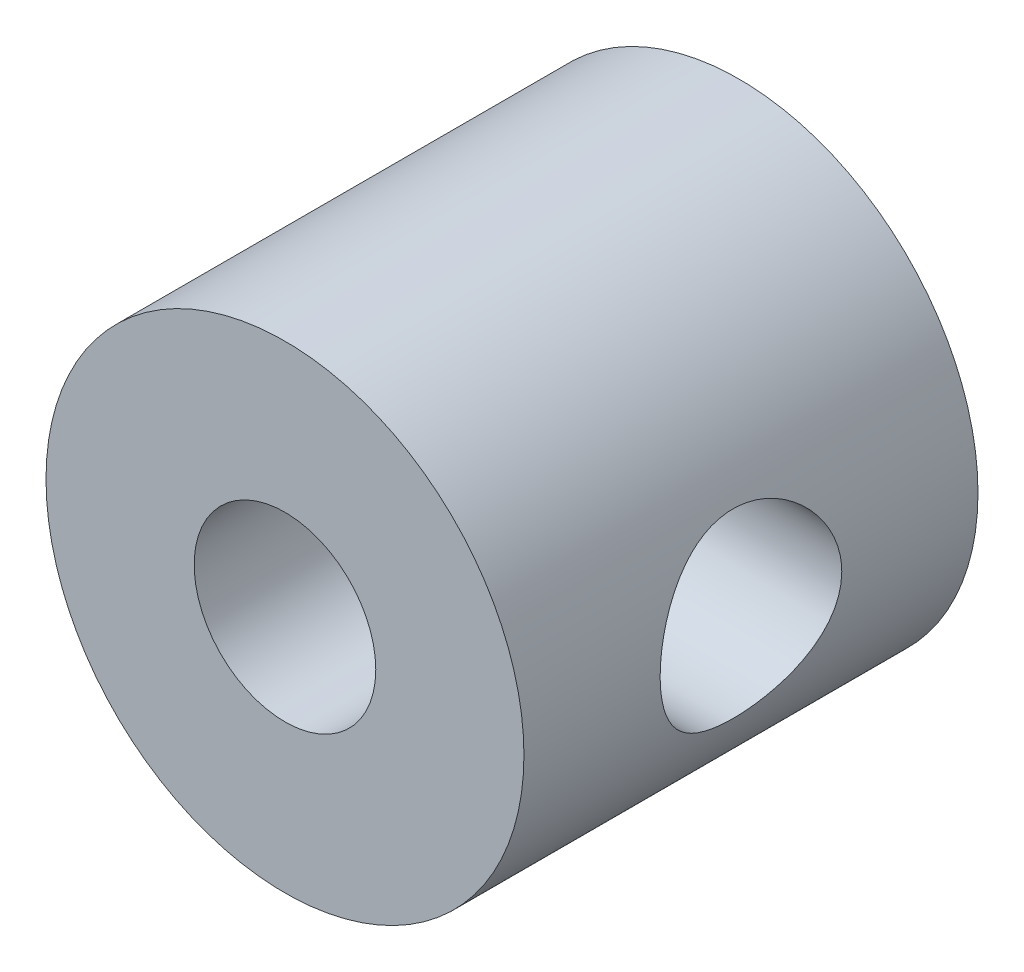
ISO-10303-21;
HEADER;
FILE_DESCRIPTION(('STEP AP214'),'2;1');
FILE_NAME('part.step','',(''),(''),'','','');
FILE_SCHEMA(('AUTOMOTIVE_DESIGN { 1 0 10303 214 1 1 1 1 }'));
ENDSEC;
DATA;
#1=APPLICATION_CONTEXT('core data for automotive mechanical design processes');
#2=APPLICATION_PROTOCOL_DEFINITION('international standard','automotive_design',2000,#1);
#3=PRODUCT_CONTEXT('',#1,'mechanical');
#4=PRODUCT('Part','Part','',(#3));
#5=PRODUCT_RELATED_PRODUCT_CATEGORY('part','',(#4));
#6=PRODUCT_DEFINITION_FORMATION('','',#4);
#7=PRODUCT_DEFINITION_CONTEXT('part definition',#1,'design');
#8=PRODUCT_DEFINITION('design','',#6,#7);
#9=PRODUCT_DEFINITION_SHAPE('','',#8);
#10=(LENGTH_UNIT() NAMED_UNIT(*) SI_UNIT(.MILLI.,.METRE.));
#11=(NAMED_UNIT(*) PLANE_ANGLE_UNIT() SI_UNIT($,.RADIAN.));
#12=(NAMED_UNIT(*) SI_UNIT($,.STERADIAN.) SOLID_ANGLE_UNIT());
#13=UNCERTAINTY_MEASURE_WITH_UNIT(LENGTH_MEASURE(1.E-05),#10,'distance_accuracy_value','');
#14=(GEOMETRIC_REPRESENTATION_CONTEXT(3) GLOBAL_UNCERTAINTY_ASSIGNED_CONTEXT((#13)) GLOBAL_UNIT_ASSIGNED_CONTEXT((#10,
#11,#12)) REPRESENTATION_CONTEXT('',''));
#15=CARTESIAN_POINT('',(0.,0.,0.));
#16=DIRECTION('',(0.,0.,1.));
#17=DIRECTION('',(1.,0.,0.));
#18=AXIS2_PLACEMENT_3D('',#15,#16,#17);
#19=CARTESIAN_POINT('',(0.,0.,0.));
#20=DIRECTION('',(0.,0.,1.));
#21=DIRECTION('',(1.,0.,0.));
#22=AXIS2_PLACEMENT_3D('',#19,#20,#21);
#23=CYLINDRICAL_SURFACE('',#22,1.9);
#24=CARTESIAN_POINT('',(0.,0.,9.5));
#25=DIRECTION('',(0.,0.,1.));
#26=DIRECTION('',(1.,0.,0.));
#27=AXIS2_PLACEMENT_3D('',#24,#25,#26);
#28=CIRCLE('',#27,1.9);
#29=CARTESIAN_POINT('',(1.9,0.,9.5));
#30=VERTEX_POINT('',#29);
#31=EDGE_CURVE('E85',#30,#30,#28,.T.);
#32=ORIENTED_EDGE('',*,*,#31,.T.);
#33=EDGE_LOOP('',(#32));
#34=FACE_BOUND('',#33,.T.);
#35=CARTESIAN_POINT('',(0.,0.,4.75));
#36=DIRECTION('',(-0.707106781186547,0.,0.707106781186547));
#37=DIRECTION('',(0.707106781186547,0.,0.707106781186547));
#38=AXIS2_PLACEMENT_3D('',#35,#36,#37);
#39=ELLIPSE('',#38,2.68700576850888,1.9);
#40=CARTESIAN_POINT('',(0.,1.9,4.75));
#41=VERTEX_POINT('',#40);
#42=CARTESIAN_POINT('',(0.,-1.9,4.75));
#43=VERTEX_POINT('',#42);
#44=EDGE_CURVE('E58',#41,#43,#39,.F.);
#45=ORIENTED_EDGE('',*,*,#44,.T.);
#46=CARTESIAN_POINT('',(0.,0.,4.75));
#47=DIRECTION('',(0.707106781186547,0.,0.707106781186547));
#48=DIRECTION('',(-0.707106781186547,0.,0.707106781186547));
#49=AXIS2_PLACEMENT_3D('',#46,#47,#48);
#50=ELLIPSE('',#49,2.68700576850888,1.9);
#51=EDGE_CURVE('E11',#43,#41,#50,.F.);
#52=ORIENTED_EDGE('',*,*,#51,.T.);
#53=EDGE_LOOP('',(#45,#52));
#54=FACE_BOUND('',#53,.T.);
#55=ADVANCED_FACE('F43',(#34,#54),#23,.F.);
#56=CARTESIAN_POINT('',(0.,0.,9.5));
#57=DIRECTION('',(0.,0.,-1.));
#58=DIRECTION('',(-1.,0.,0.));
#59=AXIS2_PLACEMENT_3D('',#56,#57,#58);
#60=CYLINDRICAL_SURFACE('',#59,5.);
#61=CARTESIAN_POINT('',(-5.,0.,2.85));
#62=CARTESIAN_POINT('',(-5.00000314148827,0.102799946037765,2.84999584618423));
#63=CARTESIAN_POINT('',(-4.99680228989486,0.205571843604519,2.85836893361314));
#64=CARTESIAN_POINT('',(-4.98435404669264,0.408038934279459,2.89150016002816));
#65=CARTESIAN_POINT('',(-4.97510770315697,0.507734657550122,2.91625545893088));
#66=CARTESIAN_POINT('',(-4.9515593739685,0.701099790647796,2.98114557793642));
#67=CARTESIAN_POINT('',(-4.93726730476453,0.79478059792097,3.02125024457916));
#68=CARTESIAN_POINT('',(-4.90504670913707,0.974076337852587,3.11554516092965));
#69=CARTESIAN_POINT('',(-4.88711718065938,1.05968903835505,3.16973929319079));
#70=CARTESIAN_POINT('',(-4.84859789590344,1.22413732997016,3.29313167643611));
#71=CARTESIAN_POINT('',(-4.82793146758365,1.30257632185067,3.36283431791343));
#72=CARTESIAN_POINT('',(-4.7866396882284,1.44697300442312,3.5141943697409));
#73=CARTESIAN_POINT('',(-4.76601435231863,1.51292672431606,3.59585556877857));
#74=CARTESIAN_POINT('',(-4.72624148165763,1.63303669782607,3.77272924039272));
#75=CARTESIAN_POINT('',(-4.70718397732858,1.68662691351059,3.86834837673399));
#76=CARTESIAN_POINT('',(-4.67390104311853,1.77678814062093,4.06808001540759));
#77=CARTESIAN_POINT('',(-4.65967362483106,1.81336615777595,4.17218900077102));
#78=CARTESIAN_POINT('',(-4.63848318884947,1.86688935206445,4.38137509299367));
#79=CARTESIAN_POINT('',(-4.63124079326371,1.88459286653868,4.48622889701143));
#80=CARTESIAN_POINT('',(-4.62402433436697,1.9022352797225,4.69764992417825));
#81=CARTESIAN_POINT('',(-4.62404716488918,1.90218177025023,4.80421639560884));
#82=CARTESIAN_POINT('',(-4.63111820371223,1.88489047329825,5.00903324960867));
#83=CARTESIAN_POINT('',(-4.63773273521278,1.86871346296971,5.10739096264822));
#84=CARTESIAN_POINT('',(-4.65651975451297,1.82139096396027,5.29987378345734));
#85=CARTESIAN_POINT('',(-4.66869310243304,1.79024315879619,5.39399823373378));
#86=CARTESIAN_POINT('',(-4.69748147158025,1.71329420545471,5.57747371282299));
#87=CARTESIAN_POINT('',(-4.71417741416087,1.66722275924216,5.66669812192209));
#88=CARTESIAN_POINT('',(-4.75010374416888,1.56192297174274,5.83645385764242));
#89=CARTESIAN_POINT('',(-4.76933502200296,1.50269000311216,5.91698211202574));
#90=CARTESIAN_POINT('',(-4.80978709665352,1.36792669110658,6.07291885227451));
#91=CARTESIAN_POINT('',(-4.83105350406012,1.29155254717806,6.14758809653555));
#92=CARTESIAN_POINT('',(-4.87203874292135,1.12712495183049,6.28328193745198));
#93=CARTESIAN_POINT('',(-4.89175732325386,1.03906961144242,6.34430432297494));
#94=CARTESIAN_POINT('',(-4.92783612775859,0.851852487995205,6.45181709832506));
#95=CARTESIAN_POINT('',(-4.94413653388479,0.752533399397338,6.49805507331473));
#96=CARTESIAN_POINT('',(-4.97109705743368,0.54675211735048,6.5729191856317));
#97=CARTESIAN_POINT('',(-4.98175974975373,0.440293209930096,6.60155336406637));
#98=CARTESIAN_POINT('',(-4.9957875569285,0.229470984419312,6.63896149494266));
#99=CARTESIAN_POINT('',(-4.99951788872478,0.125308381952605,6.6487305140866));
#100=CARTESIAN_POINT('',(-5.00039355163115,-0.0832228861010039,6.65103642794049));
#101=CARTESIAN_POINT('',(-4.99754038959186,-0.187591499072481,6.64357726588996));
#102=CARTESIAN_POINT('',(-4.98581030398745,-0.389231183311321,6.61239025498067));
#103=CARTESIAN_POINT('',(-4.97717686326153,-0.48661956252922,6.58931960487263));
#104=CARTESIAN_POINT('',(-4.95500073108836,-0.676070523965439,6.52843546753041));
#105=CARTESIAN_POINT('',(-4.9414574019024,-0.768132412531034,6.49062006507222));
#106=CARTESIAN_POINT('',(-4.91029493799233,-0.947380130569952,6.40010632845678));
#107=CARTESIAN_POINT('',(-4.89256680627251,-1.0343402755648,6.34699974496449));
#108=CARTESIAN_POINT('',(-4.85498822454556,-1.19840935888328,6.22787083372912));
#109=CARTESIAN_POINT('',(-4.83513697776912,-1.27551457482178,6.16184364933531));
#110=CARTESIAN_POINT('',(-4.79402533228151,-1.42249454419624,6.01412025587449));
#111=CARTESIAN_POINT('',(-4.77275146045522,-1.4916645142899,5.93172473214307));
#112=CARTESIAN_POINT('',(-4.73232674163432,-1.61534182230436,5.75608504575801));
#113=CARTESIAN_POINT('',(-4.71317611359821,-1.66984764881774,5.66283976625689));
#114=CARTESIAN_POINT('',(-4.67922676081744,-1.76275609269656,5.46726200672331));
#115=CARTESIAN_POINT('',(-4.66445090027486,-1.80107453812967,5.36488530080581));
#116=CARTESIAN_POINT('',(-4.64140564627876,-1.85966772399062,5.15441157034014));
#117=CARTESIAN_POINT('',(-4.63313207948134,-1.87995403901349,5.04631826249101));
#118=CARTESIAN_POINT('',(-4.62459224889872,-1.90085822079159,4.83513950016959));
#119=CARTESIAN_POINT('',(-4.62383507549612,-1.90268207203628,4.73219233513062));
#120=CARTESIAN_POINT('',(-4.62914978373433,-1.88971442556339,4.52753946976649));
#121=CARTESIAN_POINT('',(-4.63522098096587,-1.87492459303962,4.42583364605413));
#122=CARTESIAN_POINT('',(-4.65309482864238,-1.83009780463443,4.22988010563044));
#123=CARTESIAN_POINT('',(-4.66470670311429,-1.80056695115269,4.13549770118766));
#124=CARTESIAN_POINT('',(-4.69223770514172,-1.72754746605826,3.95297523134959));
#125=CARTESIAN_POINT('',(-4.70815793493193,-1.68405526209124,3.86483677067416));
#126=CARTESIAN_POINT('',(-4.74356958481196,-1.5816535247205,3.69218267263147));
#127=CARTESIAN_POINT('',(-4.76320634926203,-1.52204449455647,3.60811210695142));
#128=CARTESIAN_POINT('',(-4.80334974018232,-1.39017194395784,3.45078252466751));
#129=CARTESIAN_POINT('',(-4.82385664524132,-1.3179043471688,3.37752700480767));
#130=CARTESIAN_POINT('',(-4.86481333859486,-1.15791728108036,3.23970700825247));
#131=CARTESIAN_POINT('',(-4.88519522839751,-1.06955792182773,3.17586175872935));
#132=CARTESIAN_POINT('',(-4.92239876122345,-0.88264599508179,3.06393888130103));
#133=CARTESIAN_POINT('',(-4.93921996278201,-0.784092165900099,3.01586320814919));
#134=CARTESIAN_POINT('',(-4.96815335096176,-0.573841256525994,2.93504516837617));
#135=CARTESIAN_POINT('',(-4.97995793401086,-0.461720234475096,2.90328440532559));
#136=CARTESIAN_POINT('',(-4.99587741203959,-0.233052523820141,2.86076981982469));
#137=CARTESIAN_POINT('',(-4.99999643959643,-0.11650824805077,2.85000470772424));
#138=CARTESIAN_POINT('',(-5.,0.,2.85));
#139=B_SPLINE_CURVE_WITH_KNOTS('',3,(#61,#62,#63,#64,#65,#66,#67,#68,#69,#70,#71,#72,#73,#74,
#75,#76,#77,#78,#79,#80,#81,#82,#83,#84,#85,#86,#87,#88,#89,#90,#91,#92,#93,#94,#95,#96,#97,#98,
#99,#100,#101,#102,#103,#104,#105,#106,#107,#108,#109,#110,#111,#112,#113,#114,#115,#116,#117,
#118,#119,#120,#121,#122,#123,#124,#125,#126,#127,#128,#129,#130,#131,#132,#133,#134,#135,#136,
#137,#138),.UNSPECIFIED.,.T.,.F.,(4,2,2,2,2,2,2,2,2,2,2,2,2,2,2,2,2,2,2,2,2,2,2,2,2,2,2,2,2,2,2,
2,2,2,2,2,2,2,4),(0.,0.307969989814319,0.615886602745027,0.923201400237974,1.2306009726375,
1.55003648986385,1.86957342987414,2.20167819314484,2.53364607224951,2.85170573798024,
3.16962942101276,3.46793160007379,3.76627995133595,4.07036626171805,4.37455965276768,
4.69979074570955,5.02507449610576,5.35564718353277,5.68606875870782,5.99852705660325,
6.31091384516212,6.6109067417509,6.91093861797689,7.21987153759843,7.52892080407884,
7.85638861100008,8.18389015653176,8.51307430166362,8.84204699477762,9.14938038628981,
9.45668297644511,9.75409402108917,10.0515812263923,10.3649606558095,10.6784411868815,
11.0095285310712,11.3406569004431,11.6898823114545,12.0389198873331),.UNSPECIFIED.);
#140=CARTESIAN_POINT('',(-5.,0.,2.85));
#141=VERTEX_POINT('',#140);
#142=EDGE_CURVE('E96',#141,#141,#139,.T.);
#143=ORIENTED_EDGE('',*,*,#142,.T.);
#144=EDGE_LOOP('',(#143));
#145=FACE_BOUND('',#144,.T.);
#146=CARTESIAN_POINT('',(5.,0.,2.85));
#147=CARTESIAN_POINT('',(5.00000314148827,-0.102799946037765,2.84999584618423));
#148=CARTESIAN_POINT('',(4.99680228989486,-0.205571843604519,2.85836893361314));
#149=CARTESIAN_POINT('',(4.98435404669264,-0.408038934279459,2.89150016002816));
#150=CARTESIAN_POINT('',(4.97510770315697,-0.507734657550122,2.91625545893088));
#151=CARTESIAN_POINT('',(4.9515593739685,-0.701099790647796,2.98114557793642));
#152=CARTESIAN_POINT('',(4.93726730476453,-0.79478059792097,3.02125024457916));
#153=CARTESIAN_POINT('',(4.90504670913707,-0.974076337852587,3.11554516092965));
#154=CARTESIAN_POINT('',(4.88711718065938,-1.05968903835505,3.16973929319079));
#155=CARTESIAN_POINT('',(4.84859789590344,-1.22413732997016,3.29313167643611));
#156=CARTESIAN_POINT('',(4.82793146758365,-1.30257632185067,3.36283431791343));
#157=CARTESIAN_POINT('',(4.7866396882284,-1.44697300442312,3.5141943697409));
#158=CARTESIAN_POINT('',(4.76601435231863,-1.51292672431606,3.59585556877857));
#159=CARTESIAN_POINT('',(4.72624148165763,-1.63303669782607,3.77272924039272));
#160=CARTESIAN_POINT('',(4.70718397732858,-1.68662691351059,3.86834837673399));
#161=CARTESIAN_POINT('',(4.67390104311853,-1.77678814062093,4.06808001540759));
#162=CARTESIAN_POINT('',(4.65967362483106,-1.81336615777595,4.17218900077102));
#163=CARTESIAN_POINT('',(4.63848318884947,-1.86688935206445,4.38137509299367));
#164=CARTESIAN_POINT('',(4.63124079326371,-1.88459286653868,4.48622889701143));
#165=CARTESIAN_POINT('',(4.62402433436697,-1.9022352797225,4.69764992417825));
#166=CARTESIAN_POINT('',(4.62404716488918,-1.90218177025023,4.80421639560884));
#167=CARTESIAN_POINT('',(4.63111820371223,-1.88489047329825,5.00903324960867));
#168=CARTESIAN_POINT('',(4.63773273521278,-1.86871346296971,5.10739096264822));
#169=CARTESIAN_POINT('',(4.65651975451297,-1.82139096396027,5.29987378345734));
#170=CARTESIAN_POINT('',(4.66869310243304,-1.79024315879619,5.39399823373378));
#171=CARTESIAN_POINT('',(4.69748147158025,-1.71329420545471,5.57747371282299));
#172=CARTESIAN_POINT('',(4.71417741416087,-1.66722275924216,5.66669812192209));
#173=CARTESIAN_POINT('',(4.75010374416888,-1.56192297174274,5.83645385764242));
#174=CARTESIAN_POINT('',(4.76933502200296,-1.50269000311216,5.91698211202574));
#175=CARTESIAN_POINT('',(4.80978709665352,-1.36792669110658,6.07291885227451));
#176=CARTESIAN_POINT('',(4.83105350406012,-1.29155254717806,6.14758809653555));
#177=CARTESIAN_POINT('',(4.87203874292135,-1.12712495183049,6.28328193745198));
#178=CARTESIAN_POINT('',(4.89175732325386,-1.03906961144242,6.34430432297494));
#179=CARTESIAN_POINT('',(4.92783612775859,-0.851852487995205,6.45181709832506));
#180=CARTESIAN_POINT('',(4.94413653388479,-0.752533399397338,6.49805507331473));
#181=CARTESIAN_POINT('',(4.97109705743368,-0.54675211735048,6.5729191856317));
#182=CARTESIAN_POINT('',(4.98175974975373,-0.440293209930096,6.60155336406637));
#183=CARTESIAN_POINT('',(4.9957875569285,-0.229470984419312,6.63896149494266));
#184=CARTESIAN_POINT('',(4.99951788872478,-0.125308381952605,6.6487305140866));
#185=CARTESIAN_POINT('',(5.00039355163115,0.0832228861010039,6.65103642794049));
#186=CARTESIAN_POINT('',(4.99754038959186,0.187591499072481,6.64357726588996));
#187=CARTESIAN_POINT('',(4.98581030398745,0.389231183311321,6.61239025498067));
#188=CARTESIAN_POINT('',(4.97717686326153,0.48661956252922,6.58931960487263));
#189=CARTESIAN_POINT('',(4.95500073108836,0.676070523965439,6.52843546753041));
#190=CARTESIAN_POINT('',(4.9414574019024,0.768132412531034,6.49062006507222));
#191=CARTESIAN_POINT('',(4.91029493799233,0.947380130569952,6.40010632845678));
#192=CARTESIAN_POINT('',(4.89256680627251,1.0343402755648,6.34699974496449));
#193=CARTESIAN_POINT('',(4.85498822454556,1.19840935888328,6.22787083372912));
#194=CARTESIAN_POINT('',(4.83513697776912,1.27551457482178,6.16184364933531));
#195=CARTESIAN_POINT('',(4.79402533228151,1.42249454419624,6.01412025587449));
#196=CARTESIAN_POINT('',(4.77275146045522,1.4916645142899,5.93172473214307));
#197=CARTESIAN_POINT('',(4.73232674163432,1.61534182230436,5.75608504575801));
#198=CARTESIAN_POINT('',(4.71317611359821,1.66984764881774,5.66283976625689));
#199=CARTESIAN_POINT('',(4.67922676081744,1.76275609269656,5.46726200672331));
#200=CARTESIAN_POINT('',(4.66445090027486,1.80107453812967,5.36488530080581));
#201=CARTESIAN_POINT('',(4.64140564627876,1.85966772399062,5.15441157034014));
#202=CARTESIAN_POINT('',(4.63313207948134,1.87995403901349,5.04631826249101));
#203=CARTESIAN_POINT('',(4.62459224889872,1.90085822079159,4.83513950016959));
#204=CARTESIAN_POINT('',(4.62383507549612,1.90268207203628,4.73219233513062));
#205=CARTESIAN_POINT('',(4.62914978373433,1.88971442556339,4.52753946976649));
#206=CARTESIAN_POINT('',(4.63522098096587,1.87492459303962,4.42583364605413));
#207=CARTESIAN_POINT('',(4.65309482864238,1.83009780463443,4.22988010563044));
#208=CARTESIAN_POINT('',(4.66470670311429,1.80056695115269,4.13549770118766));
#209=CARTESIAN_POINT('',(4.69223770514172,1.72754746605826,3.95297523134959));
#210=CARTESIAN_POINT('',(4.70815793493193,1.68405526209124,3.86483677067416));
#211=CARTESIAN_POINT('',(4.74356958481196,1.5816535247205,3.69218267263147));
#212=CARTESIAN_POINT('',(4.76320634926203,1.52204449455647,3.60811210695142));
#213=CARTESIAN_POINT('',(4.80334974018232,1.39017194395784,3.45078252466751));
#214=CARTESIAN_POINT('',(4.82385664524132,1.3179043471688,3.37752700480767));
#215=CARTESIAN_POINT('',(4.86481333859486,1.15791728108036,3.23970700825247));
#216=CARTESIAN_POINT('',(4.88519522839751,1.06955792182773,3.17586175872935));
#217=CARTESIAN_POINT('',(4.92239876122345,0.88264599508179,3.06393888130103));
#218=CARTESIAN_POINT('',(4.93921996278201,0.784092165900099,3.01586320814919));
#219=CARTESIAN_POINT('',(4.96815335096176,0.573841256525994,2.93504516837617));
#220=CARTESIAN_POINT('',(4.97995793401086,0.461720234475096,2.90328440532559));
#221=CARTESIAN_POINT('',(4.99587741203959,0.233052523820141,2.86076981982469));
#222=CARTESIAN_POINT('',(4.99999643959643,0.11650824805077,2.85000470772424));
#223=CARTESIAN_POINT('',(5.,0.,2.85));
#224=B_SPLINE_CURVE_WITH_KNOTS('',3,(#146,#147,#148,#149,#150,#151,#152,#153,#154,#155,#156,
#157,#158,#159,#160,#161,#162,#163,#164,#165,#166,#167,#168,#169,#170,#171,#172,#173,#174,#175,
#176,#177,#178,#179,#180,#181,#182,#183,#184,#185,#186,#187,#188,#189,#190,#191,#192,#193,#194,
#195,#196,#197,#198,#199,#200,#201,#202,#203,#204,#205,#206,#207,#208,#209,#210,#211,#212,#213,
#214,#215,#216,#217,#218,#219,#220,#221,#222,#223),.UNSPECIFIED.,.T.,.F.,(4,2,2,2,2,2,2,2,2,2,2,
2,2,2,2,2,2,2,2,2,2,2,2,2,2,2,2,2,2,2,2,2,2,2,2,2,2,2,4),(0.,0.307969989814319,
0.615886602745027,0.923201400237974,1.2306009726375,1.55003648986385,1.86957342987414,
2.20167819314484,2.53364607224951,2.85170573798024,3.16962942101276,3.46793160007379,
3.76627995133595,4.07036626171805,4.37455965276768,4.69979074570955,5.02507449610576,
5.35564718353277,5.68606875870782,5.99852705660325,6.31091384516212,6.6109067417509,
6.91093861797689,7.21987153759843,7.52892080407884,7.85638861100008,8.18389015653176,
8.51307430166362,8.84204699477762,9.14938038628981,9.45668297644511,9.75409402108917,
10.0515812263923,10.3649606558095,10.6784411868815,11.0095285310712,11.3406569004431,
11.6898823114545,12.0389198873331),.UNSPECIFIED.);
#225=CARTESIAN_POINT('',(5.,0.,2.85));
#226=VERTEX_POINT('',#225);
#227=EDGE_CURVE('E104',#226,#226,#224,.T.);
#228=ORIENTED_EDGE('',*,*,#227,.T.);
#229=EDGE_LOOP('',(#228));
#230=FACE_BOUND('',#229,.T.);
#231=CARTESIAN_POINT('',(0.,0.,9.5));
#232=DIRECTION('',(0.,0.,1.));
#233=DIRECTION('',(1.,0.,0.));
#234=AXIS2_PLACEMENT_3D('',#231,#232,#233);
#235=CIRCLE('',#234,5.);
#236=CARTESIAN_POINT('',(5.,0.,9.5));
#237=VERTEX_POINT('',#236);
#238=EDGE_CURVE('E75',#237,#237,#235,.T.);
#239=ORIENTED_EDGE('',*,*,#238,.F.);
#240=EDGE_LOOP('',(#239));
#241=FACE_BOUND('',#240,.T.);
#242=CARTESIAN_POINT('',(0.,0.,0.));
#243=DIRECTION('',(0.,0.,1.));
#244=DIRECTION('',(1.,0.,0.));
#245=AXIS2_PLACEMENT_3D('',#242,#243,#244);
#246=CIRCLE('',#245,5.);
#247=CARTESIAN_POINT('',(5.,0.,0.));
#248=VERTEX_POINT('',#247);
#249=EDGE_CURVE('E81',#248,#248,#246,.T.);
#250=ORIENTED_EDGE('',*,*,#249,.T.);
#251=EDGE_LOOP('',(#250));
#252=FACE_BOUND('',#251,.T.);
#253=ADVANCED_FACE('F45',(#145,#230,#241,#252),#60,.T.);
#254=CARTESIAN_POINT('',(0.,0.,9.5));
#255=DIRECTION('',(0.,0.,1.));
#256=DIRECTION('',(1.,0.,0.));
#257=AXIS2_PLACEMENT_3D('',#254,#255,#256);
#258=PLANE('',#257);
#259=ORIENTED_EDGE('',*,*,#31,.F.);
#260=EDGE_LOOP('',(#259));
#261=FACE_BOUND('',#260,.T.);
#262=ORIENTED_EDGE('',*,*,#238,.T.);
#263=EDGE_LOOP('',(#262));
#264=FACE_BOUND('',#263,.T.);
#265=ADVANCED_FACE('F115',(#261,#264),#258,.T.);
#266=CARTESIAN_POINT('',(0.,0.,0.));
#267=DIRECTION('',(0.,0.,1.));
#268=DIRECTION('',(1.,0.,0.));
#269=AXIS2_PLACEMENT_3D('',#266,#267,#268);
#270=PLANE('',#269);
#271=CARTESIAN_POINT('',(0.,0.,0.));
#272=DIRECTION('',(0.,0.,1.));
#273=DIRECTION('',(1.,0.,0.));
#274=AXIS2_PLACEMENT_3D('',#271,#272,#273);
#275=CIRCLE('',#274,1.9);
#276=CARTESIAN_POINT('',(1.9,0.,0.));
#277=VERTEX_POINT('',#276);
#278=EDGE_CURVE('E92',#277,#277,#275,.T.);
#279=ORIENTED_EDGE('',*,*,#278,.T.);
#280=EDGE_LOOP('',(#279));
#281=FACE_BOUND('',#280,.T.);
#282=ORIENTED_EDGE('',*,*,#249,.F.);
#283=EDGE_LOOP('',(#282));
#284=FACE_BOUND('',#283,.T.);
#285=ADVANCED_FACE('F114',(#281,#284),#270,.F.);
#286=CARTESIAN_POINT('',(0.,0.,4.75));
#287=DIRECTION('',(-0.707106781186547,0.,0.707106781186547));
#288=DIRECTION('',(0.707106781186547,0.,0.707106781186547));
#289=AXIS2_PLACEMENT_3D('',#286,#287,#288);
#290=ELLIPSE('',#289,2.68700576850888,1.9);
#291=EDGE_CURVE('E64',#41,#43,#290,.T.);
#292=ORIENTED_EDGE('',*,*,#291,.T.);
#293=CARTESIAN_POINT('',(0.,0.,4.75));
#294=DIRECTION('',(0.707106781186547,0.,0.707106781186547));
#295=DIRECTION('',(-0.707106781186547,0.,0.707106781186547));
#296=AXIS2_PLACEMENT_3D('',#293,#294,#295);
#297=ELLIPSE('',#296,2.68700576850888,1.9);
#298=EDGE_CURVE('E53',#43,#41,#297,.T.);
#299=ORIENTED_EDGE('',*,*,#298,.T.);
#300=EDGE_LOOP('',(#292,#299));
#301=FACE_BOUND('',#300,.T.);
#302=ORIENTED_EDGE('',*,*,#278,.F.);
#303=EDGE_LOOP('',(#302));
#304=FACE_BOUND('',#303,.T.);
#305=ADVANCED_FACE('F77',(#301,#304),#23,.F.);
#306=CARTESIAN_POINT('',(-5.,0.,4.75));
#307=DIRECTION('',(1.,0.,0.));
#308=DIRECTION('',(0.,0.,-1.));
#309=AXIS2_PLACEMENT_3D('',#306,#307,#308);
#310=CYLINDRICAL_SURFACE('',#309,1.9);
#311=ORIENTED_EDGE('',*,*,#44,.F.);
#312=ORIENTED_EDGE('',*,*,#298,.F.);
#313=EDGE_LOOP('',(#311,#312));
#314=FACE_BOUND('',#313,.T.);
#315=ORIENTED_EDGE('',*,*,#227,.F.);
#316=EDGE_LOOP('',(#315));
#317=FACE_BOUND('',#316,.T.);
#318=ADVANCED_FACE('F72',(#314,#317),#310,.F.);
#319=ORIENTED_EDGE('',*,*,#291,.F.);
#320=ORIENTED_EDGE('',*,*,#51,.F.);
#321=EDGE_LOOP('',(#319,#320));
#322=FACE_BOUND('',#321,.T.);
#323=ORIENTED_EDGE('',*,*,#142,.F.);
#324=EDGE_LOOP('',(#323));
#325=FACE_BOUND('',#324,.T.);
#326=ADVANCED_FACE('F65',(#322,#325),#310,.F.);
#327=CLOSED_SHELL('',(#55,#253,#265,#285,#305,#318,#326));
#328=MANIFOLD_SOLID_BREP('B2',#327);
#329=ADVANCED_BREP_SHAPE_REPRESENTATION('',(#18,#328),#14);
#330=SHAPE_DEFINITION_REPRESENTATION(#9,#329);
ENDSEC;
END-ISO-10303-21;
